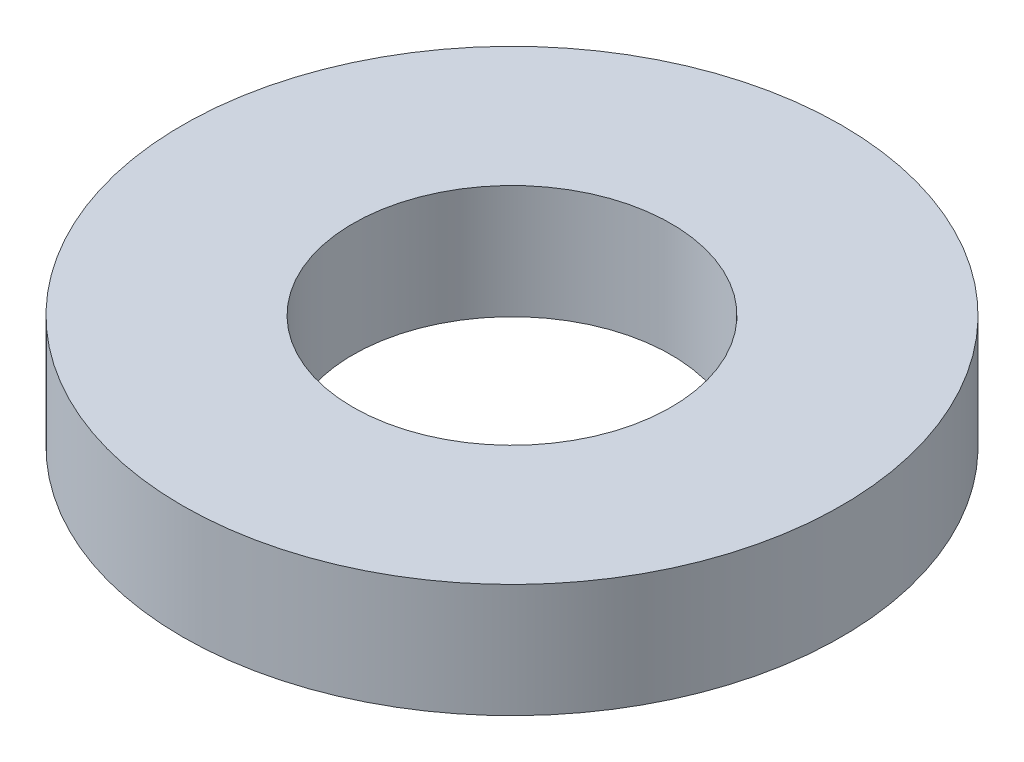
ISO-10303-21;
HEADER;
FILE_DESCRIPTION(('STEP AP214'),'2;1');
FILE_NAME('part.step','',(''),(''),'','','');
FILE_SCHEMA(('AUTOMOTIVE_DESIGN { 1 0 10303 214 1 1 1 1 }'));
ENDSEC;
DATA;
#1=APPLICATION_CONTEXT('core data for automotive mechanical design processes');
#2=APPLICATION_PROTOCOL_DEFINITION('international standard','automotive_design',2000,#1);
#3=PRODUCT_CONTEXT('',#1,'mechanical');
#4=PRODUCT('Part','Part','',(#3));
#5=PRODUCT_RELATED_PRODUCT_CATEGORY('part','',(#4));
#6=PRODUCT_DEFINITION_FORMATION('','',#4);
#7=PRODUCT_DEFINITION_CONTEXT('part definition',#1,'design');
#8=PRODUCT_DEFINITION('design','',#6,#7);
#9=PRODUCT_DEFINITION_SHAPE('','',#8);
#10=(LENGTH_UNIT() NAMED_UNIT(*) SI_UNIT(.MILLI.,.METRE.));
#11=(NAMED_UNIT(*) PLANE_ANGLE_UNIT() SI_UNIT($,.RADIAN.));
#12=(NAMED_UNIT(*) SI_UNIT($,.STERADIAN.) SOLID_ANGLE_UNIT());
#13=UNCERTAINTY_MEASURE_WITH_UNIT(LENGTH_MEASURE(1.E-05),#10,'distance_accuracy_value','');
#14=(GEOMETRIC_REPRESENTATION_CONTEXT(3) GLOBAL_UNCERTAINTY_ASSIGNED_CONTEXT((#13)) GLOBAL_UNIT_ASSIGNED_CONTEXT((#10,
#11,#12)) REPRESENTATION_CONTEXT('',''));
#15=CARTESIAN_POINT('',(0.,0.,0.));
#16=DIRECTION('',(0.,0.,1.));
#17=DIRECTION('',(1.,0.,0.));
#18=AXIS2_PLACEMENT_3D('',#15,#16,#17);
#19=CARTESIAN_POINT('',(0.,25.,0.));
#20=DIRECTION('',(0.,-1.,0.));
#21=DIRECTION('',(0.,0.,-1.));
#22=AXIS2_PLACEMENT_3D('',#19,#20,#21);
#23=CYLINDRICAL_SURFACE('',#22,72.5);
#24=CARTESIAN_POINT('',(0.,25.,0.));
#25=DIRECTION('',(0.,1.,0.));
#26=DIRECTION('',(0.,0.,1.));
#27=AXIS2_PLACEMENT_3D('',#24,#25,#26);
#28=CIRCLE('',#27,72.5);
#29=CARTESIAN_POINT('',(0.,25.,72.5));
#30=VERTEX_POINT('',#29);
#31=EDGE_CURVE('E10',#30,#30,#28,.T.);
#32=ORIENTED_EDGE('',*,*,#31,.F.);
#33=EDGE_LOOP('',(#32));
#34=FACE_BOUND('',#33,.T.);
#35=CARTESIAN_POINT('',(0.,0.,0.));
#36=DIRECTION('',(0.,1.,0.));
#37=DIRECTION('',(0.,0.,1.));
#38=AXIS2_PLACEMENT_3D('',#35,#36,#37);
#39=CIRCLE('',#38,72.5);
#40=CARTESIAN_POINT('',(0.,0.,72.5));
#41=VERTEX_POINT('',#40);
#42=EDGE_CURVE('E37',#41,#41,#39,.T.);
#43=ORIENTED_EDGE('',*,*,#42,.T.);
#44=EDGE_LOOP('',(#43));
#45=FACE_BOUND('',#44,.T.);
#46=ADVANCED_FACE('F40',(#34,#45),#23,.T.);
#47=CARTESIAN_POINT('',(0.,25.,0.));
#48=DIRECTION('',(0.,1.,0.));
#49=DIRECTION('',(0.,0.,1.));
#50=AXIS2_PLACEMENT_3D('',#47,#48,#49);
#51=PLANE('',#50);
#52=CARTESIAN_POINT('',(0.,25.,0.));
#53=DIRECTION('',(0.,1.,0.));
#54=DIRECTION('',(0.,0.,1.));
#55=AXIS2_PLACEMENT_3D('',#52,#53,#54);
#56=CIRCLE('',#55,35.);
#57=CARTESIAN_POINT('',(0.,25.,35.));
#58=VERTEX_POINT('',#57);
#59=EDGE_CURVE('E50',#58,#58,#56,.T.);
#60=ORIENTED_EDGE('',*,*,#59,.F.);
#61=EDGE_LOOP('',(#60));
#62=FACE_BOUND('',#61,.T.);
#63=ORIENTED_EDGE('',*,*,#31,.T.);
#64=EDGE_LOOP('',(#63));
#65=FACE_BOUND('',#64,.T.);
#66=ADVANCED_FACE('F59',(#62,#65),#51,.T.);
#67=CARTESIAN_POINT('',(0.,0.,0.));
#68=DIRECTION('',(0.,1.,0.));
#69=DIRECTION('',(0.,0.,1.));
#70=AXIS2_PLACEMENT_3D('',#67,#68,#69);
#71=PLANE('',#70);
#72=CARTESIAN_POINT('',(0.,0.,0.));
#73=DIRECTION('',(0.,1.,0.));
#74=DIRECTION('',(0.,0.,1.));
#75=AXIS2_PLACEMENT_3D('',#72,#73,#74);
#76=CIRCLE('',#75,35.);
#77=CARTESIAN_POINT('',(0.,0.,35.));
#78=VERTEX_POINT('',#77);
#79=EDGE_CURVE('E47',#78,#78,#76,.T.);
#80=ORIENTED_EDGE('',*,*,#79,.T.);
#81=EDGE_LOOP('',(#80));
#82=FACE_BOUND('',#81,.T.);
#83=ORIENTED_EDGE('',*,*,#42,.F.);
#84=EDGE_LOOP('',(#83));
#85=FACE_BOUND('',#84,.T.);
#86=ADVANCED_FACE('F58',(#82,#85),#71,.F.);
#87=CARTESIAN_POINT('',(0.,25.,0.));
#88=DIRECTION('',(0.,-1.,0.));
#89=DIRECTION('',(0.,0.,-1.));
#90=AXIS2_PLACEMENT_3D('',#87,#88,#89);
#91=CYLINDRICAL_SURFACE('',#90,35.);
#92=ORIENTED_EDGE('',*,*,#59,.T.);
#93=EDGE_LOOP('',(#92));
#94=FACE_BOUND('',#93,.T.);
#95=ORIENTED_EDGE('',*,*,#79,.F.);
#96=EDGE_LOOP('',(#95));
#97=FACE_BOUND('',#96,.T.);
#98=ADVANCED_FACE('F54',(#94,#97),#91,.F.);
#99=CLOSED_SHELL('',(#46,#66,#86,#98));
#100=MANIFOLD_SOLID_BREP('B2',#99);
#101=ADVANCED_BREP_SHAPE_REPRESENTATION('',(#18,#100),#14);
#102=SHAPE_DEFINITION_REPRESENTATION(#9,#101);
ENDSEC;
END-ISO-10303-21;
